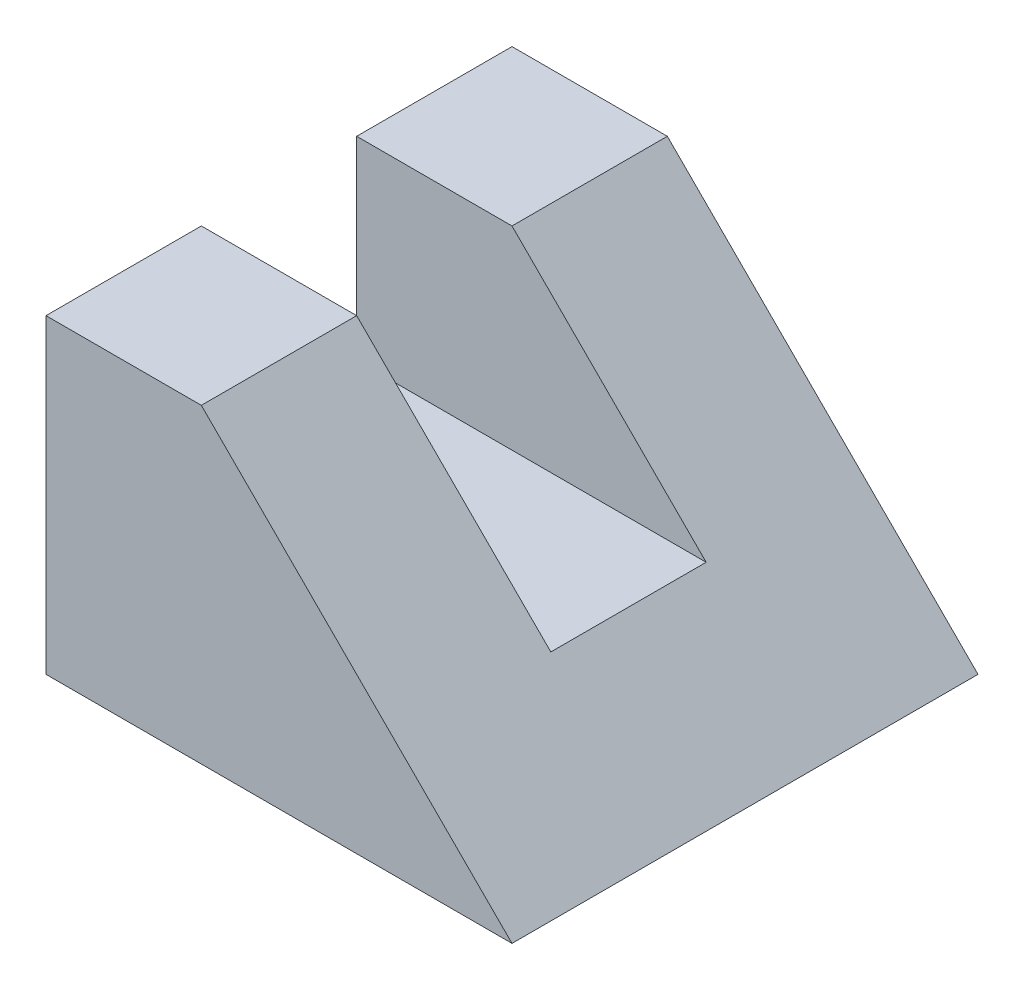
ISO-10303-21;
HEADER;
FILE_DESCRIPTION(('STEP AP214'),'2;1');
FILE_NAME('part.step','',(''),(''),'','','');
FILE_SCHEMA(('AUTOMOTIVE_DESIGN { 1 0 10303 214 1 1 1 1 }'));
ENDSEC;
DATA;
#1=APPLICATION_CONTEXT('core data for automotive mechanical design processes');
#2=APPLICATION_PROTOCOL_DEFINITION('international standard','automotive_design',2000,#1);
#3=PRODUCT_CONTEXT('',#1,'mechanical');
#4=PRODUCT('Part','Part','',(#3));
#5=PRODUCT_RELATED_PRODUCT_CATEGORY('part','',(#4));
#6=PRODUCT_DEFINITION_FORMATION('','',#4);
#7=PRODUCT_DEFINITION_CONTEXT('part definition',#1,'design');
#8=PRODUCT_DEFINITION('design','',#6,#7);
#9=PRODUCT_DEFINITION_SHAPE('','',#8);
#10=(LENGTH_UNIT() NAMED_UNIT(*) SI_UNIT(.MILLI.,.METRE.));
#11=(NAMED_UNIT(*) PLANE_ANGLE_UNIT() SI_UNIT($,.RADIAN.));
#12=(NAMED_UNIT(*) SI_UNIT($,.STERADIAN.) SOLID_ANGLE_UNIT());
#13=UNCERTAINTY_MEASURE_WITH_UNIT(LENGTH_MEASURE(1.E-05),#10,'distance_accuracy_value','');
#14=(GEOMETRIC_REPRESENTATION_CONTEXT(3) GLOBAL_UNCERTAINTY_ASSIGNED_CONTEXT((#13)) GLOBAL_UNIT_ASSIGNED_CONTEXT((#10,
#11,#12)) REPRESENTATION_CONTEXT('',''));
#15=CARTESIAN_POINT('',(0.,0.,0.));
#16=DIRECTION('',(0.,0.,1.));
#17=DIRECTION('',(1.,0.,0.));
#18=AXIS2_PLACEMENT_3D('',#15,#16,#17);
#19=CARTESIAN_POINT('',(-300.,400.,300.));
#20=DIRECTION('',(1.,0.,0.));
#21=DIRECTION('',(0.,0.,-1.));
#22=AXIS2_PLACEMENT_3D('',#19,#20,#21);
#23=PLANE('',#22);
#24=DIRECTION('',(0.,1.,0.));
#25=VECTOR('',#24,1.);
#26=CARTESIAN_POINT('',(-300.,150.,-100.));
#27=LINE('',#26,#25);
#28=CARTESIAN_POINT('',(-300.,150.,-100.));
#29=VERTEX_POINT('',#28);
#30=CARTESIAN_POINT('',(-300.,400.,-100.));
#31=VERTEX_POINT('',#30);
#32=EDGE_CURVE('E102',#29,#31,#27,.T.);
#33=ORIENTED_EDGE('',*,*,#32,.T.);
#34=DIRECTION('',(0.,0.,1.));
#35=VECTOR('',#34,1.);
#36=CARTESIAN_POINT('',(-300.,400.,-300.));
#37=LINE('',#36,#35);
#38=CARTESIAN_POINT('',(-300.,400.,-300.));
#39=VERTEX_POINT('',#38);
#40=EDGE_CURVE('E139',#39,#31,#37,.T.);
#41=ORIENTED_EDGE('',*,*,#40,.F.);
#42=DIRECTION('',(0.,-1.,0.));
#43=VECTOR('',#42,1.);
#44=CARTESIAN_POINT('',(-300.,400.,-300.));
#45=LINE('',#44,#43);
#46=CARTESIAN_POINT('',(-300.,0.,-300.));
#47=VERTEX_POINT('',#46);
#48=EDGE_CURVE('E136',#39,#47,#45,.T.);
#49=ORIENTED_EDGE('',*,*,#48,.T.);
#50=DIRECTION('',(0.,0.,-1.));
#51=VECTOR('',#50,1.);
#52=CARTESIAN_POINT('',(-300.,0.,300.));
#53=LINE('',#52,#51);
#54=CARTESIAN_POINT('',(-300.,0.,300.));
#55=VERTEX_POINT('',#54);
#56=EDGE_CURVE('E159',#55,#47,#53,.T.);
#57=ORIENTED_EDGE('',*,*,#56,.F.);
#58=DIRECTION('',(0.,-1.,0.));
#59=VECTOR('',#58,1.);
#60=CARTESIAN_POINT('',(-300.,400.,300.));
#61=LINE('',#60,#59);
#62=CARTESIAN_POINT('',(-300.,400.,300.));
#63=VERTEX_POINT('',#62);
#64=EDGE_CURVE('E150',#63,#55,#61,.T.);
#65=ORIENTED_EDGE('',*,*,#64,.F.);
#66=DIRECTION('',(0.,0.,-1.));
#67=VECTOR('',#66,1.);
#68=CARTESIAN_POINT('',(-300.,400.,300.));
#69=LINE('',#68,#67);
#70=CARTESIAN_POINT('',(-300.,400.,100.));
#71=VERTEX_POINT('',#70);
#72=EDGE_CURVE('E41',#63,#71,#69,.T.);
#73=ORIENTED_EDGE('',*,*,#72,.T.);
#74=DIRECTION('',(0.,1.,0.));
#75=VECTOR('',#74,1.);
#76=CARTESIAN_POINT('',(-300.,150.,100.));
#77=LINE('',#76,#75);
#78=CARTESIAN_POINT('',(-300.,150.,100.));
#79=VERTEX_POINT('',#78);
#80=EDGE_CURVE('E105',#79,#71,#77,.T.);
#81=ORIENTED_EDGE('',*,*,#80,.F.);
#82=DIRECTION('',(0.,0.,1.));
#83=VECTOR('',#82,1.);
#84=CARTESIAN_POINT('',(-300.,150.,0.));
#85=LINE('',#84,#83);
#86=EDGE_CURVE('E99',#29,#79,#85,.T.);
#87=ORIENTED_EDGE('',*,*,#86,.F.);
#88=EDGE_LOOP('',(#33,#41,#49,#57,#65,#73,#81,#87));
#89=FACE_BOUND('',#88,.T.);
#90=ADVANCED_FACE('F33',(#89),#23,.F.);
#91=CARTESIAN_POINT('',(300.,0.,300.));
#92=DIRECTION('',(-0.707106781186548,-0.707106781186547,0.));
#93=DIRECTION('',(0.707106781186547,-0.707106781186548,0.));
#94=AXIS2_PLACEMENT_3D('',#91,#92,#93);
#95=PLANE('',#94);
#96=DIRECTION('',(-0.707106781186547,0.707106781186548,0.));
#97=VECTOR('',#96,1.);
#98=CARTESIAN_POINT('',(300.,0.,-100.));
#99=LINE('',#98,#97);
#100=CARTESIAN_POINT('',(150.,150.,-100.));
#101=VERTEX_POINT('',#100);
#102=CARTESIAN_POINT('',(-100.,400.,-100.));
#103=VERTEX_POINT('',#102);
#104=EDGE_CURVE('E122',#101,#103,#99,.T.);
#105=ORIENTED_EDGE('',*,*,#104,.F.);
#106=DIRECTION('',(0.,0.,-1.));
#107=VECTOR('',#106,1.);
#108=CARTESIAN_POINT('',(150.,150.,300.));
#109=LINE('',#108,#107);
#110=CARTESIAN_POINT('',(150.,150.,100.));
#111=VERTEX_POINT('',#110);
#112=EDGE_CURVE('E115',#111,#101,#109,.T.);
#113=ORIENTED_EDGE('',*,*,#112,.F.);
#114=DIRECTION('',(-0.707106781186547,0.707106781186548,0.));
#115=VECTOR('',#114,1.);
#116=CARTESIAN_POINT('',(300.,0.,100.));
#117=LINE('',#116,#115);
#118=CARTESIAN_POINT('',(-100.,400.,100.));
#119=VERTEX_POINT('',#118);
#120=EDGE_CURVE('E11',#111,#119,#117,.T.);
#121=ORIENTED_EDGE('',*,*,#120,.T.);
#122=DIRECTION('',(0.,0.,-1.));
#123=VECTOR('',#122,1.);
#124=CARTESIAN_POINT('',(-100.,400.,300.));
#125=LINE('',#124,#123);
#126=CARTESIAN_POINT('',(-100.,400.,300.));
#127=VERTEX_POINT('',#126);
#128=EDGE_CURVE('E154',#127,#119,#125,.T.);
#129=ORIENTED_EDGE('',*,*,#128,.F.);
#130=DIRECTION('',(-0.707106781186547,0.707106781186548,0.));
#131=VECTOR('',#130,1.);
#132=CARTESIAN_POINT('',(300.,0.,300.));
#133=LINE('',#132,#131);
#134=CARTESIAN_POINT('',(300.,0.,300.));
#135=VERTEX_POINT('',#134);
#136=EDGE_CURVE('E48',#135,#127,#133,.T.);
#137=ORIENTED_EDGE('',*,*,#136,.F.);
#138=DIRECTION('',(0.,0.,-1.));
#139=VECTOR('',#138,1.);
#140=CARTESIAN_POINT('',(300.,0.,300.));
#141=LINE('',#140,#139);
#142=CARTESIAN_POINT('',(300.,0.,-300.));
#143=VERTEX_POINT('',#142);
#144=EDGE_CURVE('E157',#135,#143,#141,.T.);
#145=ORIENTED_EDGE('',*,*,#144,.T.);
#146=DIRECTION('',(-0.707106781186547,0.707106781186548,0.));
#147=VECTOR('',#146,1.);
#148=CARTESIAN_POINT('',(300.,0.,-300.));
#149=LINE('',#148,#147);
#150=CARTESIAN_POINT('',(-100.,400.,-300.));
#151=VERTEX_POINT('',#150);
#152=EDGE_CURVE('E130',#143,#151,#149,.T.);
#153=ORIENTED_EDGE('',*,*,#152,.T.);
#154=DIRECTION('',(0.,0.,1.));
#155=VECTOR('',#154,1.);
#156=CARTESIAN_POINT('',(-100.,400.,-300.));
#157=LINE('',#156,#155);
#158=EDGE_CURVE('E141',#151,#103,#157,.T.);
#159=ORIENTED_EDGE('',*,*,#158,.T.);
#160=EDGE_LOOP('',(#105,#113,#121,#129,#137,#145,#153,#159));
#161=FACE_BOUND('',#160,.T.);
#162=ADVANCED_FACE('F168',(#161),#95,.F.);
#163=CARTESIAN_POINT('',(-100.,400.,-300.));
#164=DIRECTION('',(0.,1.,0.));
#165=DIRECTION('',(0.,0.,1.));
#166=AXIS2_PLACEMENT_3D('',#163,#164,#165);
#167=PLANE('',#166);
#168=ORIENTED_EDGE('',*,*,#40,.T.);
#169=DIRECTION('',(1.,0.,0.));
#170=VECTOR('',#169,1.);
#171=CARTESIAN_POINT('',(-300.,400.,-100.));
#172=LINE('',#171,#170);
#173=EDGE_CURVE('E118',#31,#103,#172,.T.);
#174=ORIENTED_EDGE('',*,*,#173,.T.);
#175=ORIENTED_EDGE('',*,*,#158,.F.);
#176=DIRECTION('',(-1.,0.,0.));
#177=VECTOR('',#176,1.);
#178=CARTESIAN_POINT('',(-100.,400.,-300.));
#179=LINE('',#178,#177);
#180=EDGE_CURVE('E124',#151,#39,#179,.T.);
#181=ORIENTED_EDGE('',*,*,#180,.T.);
#182=EDGE_LOOP('',(#168,#174,#175,#181));
#183=FACE_BOUND('',#182,.T.);
#184=ADVANCED_FACE('F170',(#183),#167,.T.);
#185=CARTESIAN_POINT('',(-100.,400.,300.));
#186=DIRECTION('',(0.,-1.,0.));
#187=DIRECTION('',(0.,0.,-1.));
#188=AXIS2_PLACEMENT_3D('',#185,#186,#187);
#189=PLANE('',#188);
#190=ORIENTED_EDGE('',*,*,#128,.T.);
#191=DIRECTION('',(1.,0.,0.));
#192=VECTOR('',#191,1.);
#193=CARTESIAN_POINT('',(-300.,400.,100.));
#194=LINE('',#193,#192);
#195=EDGE_CURVE('E109',#71,#119,#194,.T.);
#196=ORIENTED_EDGE('',*,*,#195,.F.);
#197=ORIENTED_EDGE('',*,*,#72,.F.);
#198=DIRECTION('',(-1.,0.,0.));
#199=VECTOR('',#198,1.);
#200=CARTESIAN_POINT('',(-100.,400.,300.));
#201=LINE('',#200,#199);
#202=EDGE_CURVE('E148',#127,#63,#201,.T.);
#203=ORIENTED_EDGE('',*,*,#202,.F.);
#204=EDGE_LOOP('',(#190,#196,#197,#203));
#205=FACE_BOUND('',#204,.T.);
#206=ADVANCED_FACE('F35',(#205),#189,.F.);
#207=CARTESIAN_POINT('',(-300.,0.,300.));
#208=DIRECTION('',(0.,1.,0.));
#209=DIRECTION('',(0.,0.,1.));
#210=AXIS2_PLACEMENT_3D('',#207,#208,#209);
#211=PLANE('',#210);
#212=ORIENTED_EDGE('',*,*,#56,.T.);
#213=DIRECTION('',(1.,0.,0.));
#214=VECTOR('',#213,1.);
#215=CARTESIAN_POINT('',(-300.,0.,-300.));
#216=LINE('',#215,#214);
#217=EDGE_CURVE('E133',#47,#143,#216,.T.);
#218=ORIENTED_EDGE('',*,*,#217,.T.);
#219=ORIENTED_EDGE('',*,*,#144,.F.);
#220=DIRECTION('',(1.,0.,0.));
#221=VECTOR('',#220,1.);
#222=CARTESIAN_POINT('',(-300.,0.,300.));
#223=LINE('',#222,#221);
#224=EDGE_CURVE('E53',#55,#135,#223,.T.);
#225=ORIENTED_EDGE('',*,*,#224,.F.);
#226=EDGE_LOOP('',(#212,#218,#219,#225));
#227=FACE_BOUND('',#226,.T.);
#228=ADVANCED_FACE('F178',(#227),#211,.F.);
#229=CARTESIAN_POINT('',(0.,0.,300.));
#230=DIRECTION('',(0.,0.,1.));
#231=DIRECTION('',(1.,0.,0.));
#232=AXIS2_PLACEMENT_3D('',#229,#230,#231);
#233=PLANE('',#232);
#234=ORIENTED_EDGE('',*,*,#202,.T.);
#235=ORIENTED_EDGE('',*,*,#64,.T.);
#236=ORIENTED_EDGE('',*,*,#224,.T.);
#237=ORIENTED_EDGE('',*,*,#136,.T.);
#238=EDGE_LOOP('',(#234,#235,#236,#237));
#239=FACE_BOUND('',#238,.T.);
#240=ADVANCED_FACE('F180',(#239),#233,.T.);
#241=CARTESIAN_POINT('',(-300.,150.,100.));
#242=DIRECTION('',(0.,0.,1.));
#243=DIRECTION('',(1.,0.,0.));
#244=AXIS2_PLACEMENT_3D('',#241,#242,#243);
#245=PLANE('',#244);
#246=DIRECTION('',(1.,0.,0.));
#247=VECTOR('',#246,1.);
#248=CARTESIAN_POINT('',(-300.,150.,100.));
#249=LINE('',#248,#247);
#250=EDGE_CURVE('E108',#79,#111,#249,.T.);
#251=ORIENTED_EDGE('',*,*,#250,.F.);
#252=ORIENTED_EDGE('',*,*,#80,.T.);
#253=ORIENTED_EDGE('',*,*,#195,.T.);
#254=ORIENTED_EDGE('',*,*,#120,.F.);
#255=EDGE_LOOP('',(#251,#252,#253,#254));
#256=FACE_BOUND('',#255,.T.);
#257=ADVANCED_FACE('F166',(#256),#245,.F.);
#258=CARTESIAN_POINT('',(0.,150.,0.));
#259=DIRECTION('',(0.,1.,0.));
#260=DIRECTION('',(0.,0.,1.));
#261=AXIS2_PLACEMENT_3D('',#258,#259,#260);
#262=PLANE('',#261);
#263=ORIENTED_EDGE('',*,*,#112,.T.);
#264=DIRECTION('',(1.,0.,0.));
#265=VECTOR('',#264,1.);
#266=CARTESIAN_POINT('',(-300.,150.,-100.));
#267=LINE('',#266,#265);
#268=EDGE_CURVE('E112',#29,#101,#267,.T.);
#269=ORIENTED_EDGE('',*,*,#268,.F.);
#270=ORIENTED_EDGE('',*,*,#86,.T.);
#271=ORIENTED_EDGE('',*,*,#250,.T.);
#272=EDGE_LOOP('',(#263,#269,#270,#271));
#273=FACE_BOUND('',#272,.T.);
#274=ADVANCED_FACE('F113',(#273),#262,.T.);
#275=CARTESIAN_POINT('',(0.,0.,-300.));
#276=DIRECTION('',(0.,0.,-1.));
#277=DIRECTION('',(1.,0.,0.));
#278=AXIS2_PLACEMENT_3D('',#275,#276,#277);
#279=PLANE('',#278);
#280=ORIENTED_EDGE('',*,*,#180,.F.);
#281=ORIENTED_EDGE('',*,*,#152,.F.);
#282=ORIENTED_EDGE('',*,*,#217,.F.);
#283=ORIENTED_EDGE('',*,*,#48,.F.);
#284=EDGE_LOOP('',(#280,#281,#282,#283));
#285=FACE_BOUND('',#284,.T.);
#286=ADVANCED_FACE('F175',(#285),#279,.T.);
#287=CARTESIAN_POINT('',(-300.,150.,-100.));
#288=DIRECTION('',(0.,0.,1.));
#289=DIRECTION('',(1.,0.,0.));
#290=AXIS2_PLACEMENT_3D('',#287,#288,#289);
#291=PLANE('',#290);
#292=ORIENTED_EDGE('',*,*,#104,.T.);
#293=ORIENTED_EDGE('',*,*,#173,.F.);
#294=ORIENTED_EDGE('',*,*,#32,.F.);
#295=ORIENTED_EDGE('',*,*,#268,.T.);
#296=EDGE_LOOP('',(#292,#293,#294,#295));
#297=FACE_BOUND('',#296,.T.);
#298=ADVANCED_FACE('F120',(#297),#291,.T.);
#299=CLOSED_SHELL('',(#90,#162,#184,#206,#228,#240,#257,#274,#286,#298));
#300=MANIFOLD_SOLID_BREP('B2',#299);
#301=ADVANCED_BREP_SHAPE_REPRESENTATION('',(#18,#300),#14);
#302=SHAPE_DEFINITION_REPRESENTATION(#9,#301);
ENDSEC;
END-ISO-10303-21;
